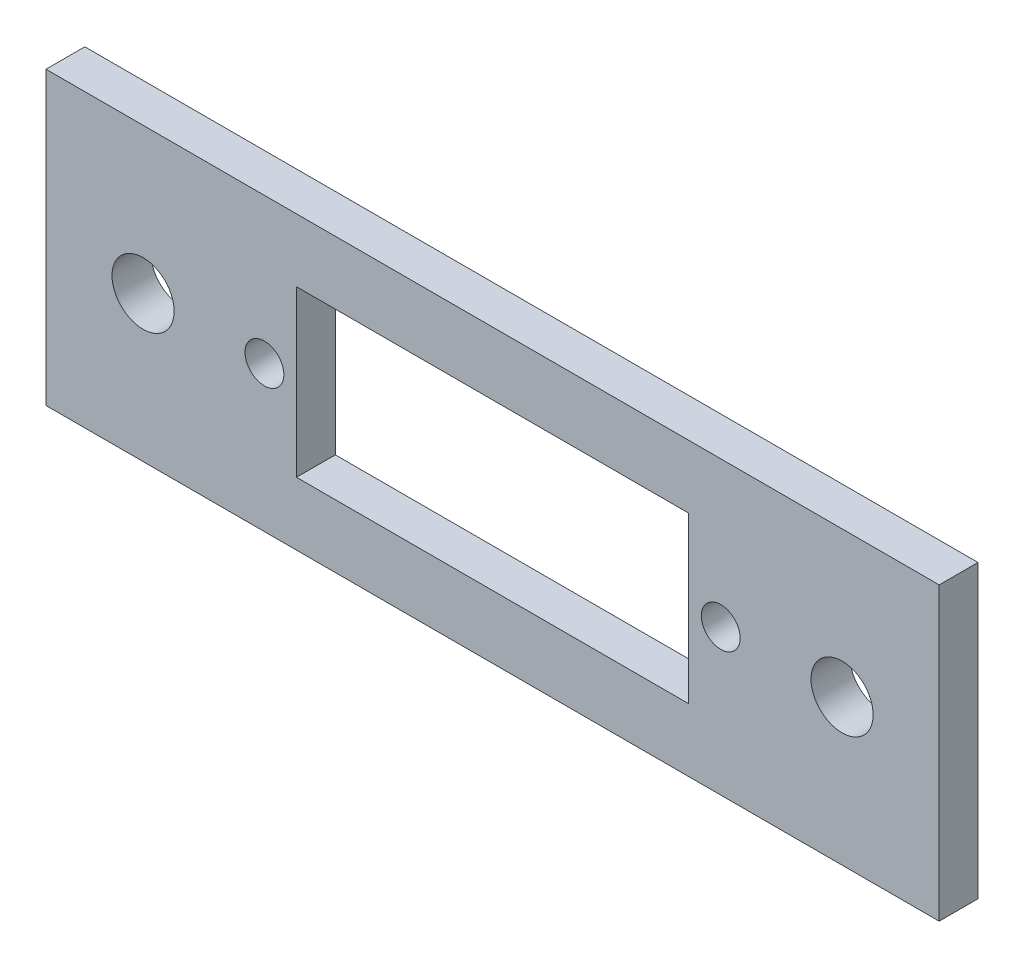
ISO-10303-21;
HEADER;
FILE_DESCRIPTION(('STEP AP214'),'2;1');
FILE_NAME('part.step','',(''),(''),'','','');
FILE_SCHEMA(('AUTOMOTIVE_DESIGN { 1 0 10303 214 1 1 1 1 }'));
ENDSEC;
DATA;
#1=APPLICATION_CONTEXT('core data for automotive mechanical design processes');
#2=APPLICATION_PROTOCOL_DEFINITION('international standard','automotive_design',2000,#1);
#3=PRODUCT_CONTEXT('',#1,'mechanical');
#4=PRODUCT('Part','Part','',(#3));
#5=PRODUCT_RELATED_PRODUCT_CATEGORY('part','',(#4));
#6=PRODUCT_DEFINITION_FORMATION('','',#4);
#7=PRODUCT_DEFINITION_CONTEXT('part definition',#1,'design');
#8=PRODUCT_DEFINITION('design','',#6,#7);
#9=PRODUCT_DEFINITION_SHAPE('','',#8);
#10=(LENGTH_UNIT() NAMED_UNIT(*) SI_UNIT(.MILLI.,.METRE.));
#11=(NAMED_UNIT(*) PLANE_ANGLE_UNIT() SI_UNIT($,.RADIAN.));
#12=(NAMED_UNIT(*) SI_UNIT($,.STERADIAN.) SOLID_ANGLE_UNIT());
#13=UNCERTAINTY_MEASURE_WITH_UNIT(LENGTH_MEASURE(1.E-05),#10,'distance_accuracy_value','');
#14=(GEOMETRIC_REPRESENTATION_CONTEXT(3) GLOBAL_UNCERTAINTY_ASSIGNED_CONTEXT((#13)) GLOBAL_UNIT_ASSIGNED_CONTEXT((#10,
#11,#12)) REPRESENTATION_CONTEXT('',''));
#15=CARTESIAN_POINT('',(0.,0.,0.));
#16=DIRECTION('',(0.,0.,1.));
#17=DIRECTION('',(1.,0.,0.));
#18=AXIS2_PLACEMENT_3D('',#15,#16,#17);
#19=CARTESIAN_POINT('',(0.,0.,0.));
#20=DIRECTION('',(0.,0.,1.));
#21=DIRECTION('',(1.,0.,0.));
#22=AXIS2_PLACEMENT_3D('',#19,#20,#21);
#23=PLANE('',#22);
#24=CARTESIAN_POINT('',(-15.2042400371844,0.,0.));
#25=DIRECTION('',(0.,0.,-1.));
#26=DIRECTION('',(-1.,0.,0.));
#27=AXIS2_PLACEMENT_3D('',#24,#25,#26);
#28=CIRCLE('',#27,1.6);
#29=CARTESIAN_POINT('',(-16.8042400371844,0.,0.));
#30=VERTEX_POINT('',#29);
#31=EDGE_CURVE('E118',#30,#30,#28,.F.);
#32=ORIENTED_EDGE('',*,*,#31,.T.);
#33=EDGE_LOOP('',(#32));
#34=FACE_BOUND('',#33,.T.);
#35=CARTESIAN_POINT('',(14.5457599628156,0.,0.));
#36=DIRECTION('',(0.,0.,-1.));
#37=DIRECTION('',(-1.,0.,0.));
#38=AXIS2_PLACEMENT_3D('',#35,#36,#37);
#39=CIRCLE('',#38,1.);
#40=CARTESIAN_POINT('',(13.5457599628156,0.,0.));
#41=VERTEX_POINT('',#40);
#42=EDGE_CURVE('E121',#41,#41,#39,.F.);
#43=ORIENTED_EDGE('',*,*,#42,.T.);
#44=EDGE_LOOP('',(#43));
#45=FACE_BOUND('',#44,.T.);
#46=DIRECTION('',(1.,0.,0.));
#47=VECTOR('',#46,1.);
#48=CARTESIAN_POINT('',(12.8957599628156,4.25,0.));
#49=LINE('',#48,#47);
#50=CARTESIAN_POINT('',(-7.30424003718442,4.24999999999995,0.));
#51=VERTEX_POINT('',#50);
#52=CARTESIAN_POINT('',(12.8957599628156,4.24999999999998,0.));
#53=VERTEX_POINT('',#52);
#54=EDGE_CURVE('E307',#51,#53,#49,.T.);
#55=ORIENTED_EDGE('',*,*,#54,.F.);
#56=DIRECTION('',(0.,1.,0.));
#57=VECTOR('',#56,1.);
#58=CARTESIAN_POINT('',(-7.30424003718442,4.24999999999995,0.));
#59=LINE('',#58,#57);
#60=CARTESIAN_POINT('',(-7.30424003718442,-4.25,0.));
#61=VERTEX_POINT('',#60);
#62=EDGE_CURVE('E293',#61,#51,#59,.T.);
#63=ORIENTED_EDGE('',*,*,#62,.F.);
#64=DIRECTION('',(1.,0.,0.));
#65=VECTOR('',#64,1.);
#66=CARTESIAN_POINT('',(-7.30424003718442,-4.25,0.));
#67=LINE('',#66,#65);
#68=CARTESIAN_POINT('',(12.8957599628156,-4.25,0.));
#69=VERTEX_POINT('',#68);
#70=EDGE_CURVE('E299',#69,#61,#67,.F.);
#71=ORIENTED_EDGE('',*,*,#70,.F.);
#72=DIRECTION('',(0.,-1.,0.));
#73=VECTOR('',#72,1.);
#74=CARTESIAN_POINT('',(12.8957599628156,-4.25,0.));
#75=LINE('',#74,#73);
#76=EDGE_CURVE('E304',#53,#69,#75,.T.);
#77=ORIENTED_EDGE('',*,*,#76,.F.);
#78=EDGE_LOOP('',(#55,#63,#71,#77));
#79=FACE_BOUND('',#78,.T.);
#80=DIRECTION('',(1.,0.,0.));
#81=VECTOR('',#80,1.);
#82=CARTESIAN_POINT('',(-20.2042400371844,7.49999999999999,0.));
#83=LINE('',#82,#81);
#84=CARTESIAN_POINT('',(-20.2042400371844,7.49999999999999,0.));
#85=VERTEX_POINT('',#84);
#86=CARTESIAN_POINT('',(25.7957599628156,7.49999999999999,0.));
#87=VERTEX_POINT('',#86);
#88=EDGE_CURVE('E310',#85,#87,#83,.T.);
#89=ORIENTED_EDGE('',*,*,#88,.T.);
#90=DIRECTION('',(0.,-1.,0.));
#91=VECTOR('',#90,1.);
#92=CARTESIAN_POINT('',(25.7957599628156,7.49999999999999,0.));
#93=LINE('',#92,#91);
#94=CARTESIAN_POINT('',(25.7957599628156,-7.50000000000001,0.));
#95=VERTEX_POINT('',#94);
#96=EDGE_CURVE('E97',#87,#95,#93,.T.);
#97=ORIENTED_EDGE('',*,*,#96,.T.);
#98=DIRECTION('',(1.,0.,0.));
#99=VECTOR('',#98,1.);
#100=CARTESIAN_POINT('',(-20.2042400371844,-7.50000000000001,0.));
#101=LINE('',#100,#99);
#102=CARTESIAN_POINT('',(-20.2042400371844,-7.50000000000001,0.));
#103=VERTEX_POINT('',#102);
#104=EDGE_CURVE('E80',#95,#103,#101,.F.);
#105=ORIENTED_EDGE('',*,*,#104,.T.);
#106=DIRECTION('',(0.,1.,0.));
#107=VECTOR('',#106,1.);
#108=CARTESIAN_POINT('',(-20.2042400371844,7.49999999999999,0.));
#109=LINE('',#108,#107);
#110=EDGE_CURVE('E85',#103,#85,#109,.T.);
#111=ORIENTED_EDGE('',*,*,#110,.T.);
#112=EDGE_LOOP('',(#89,#97,#105,#111));
#113=FACE_BOUND('',#112,.T.);
#114=CARTESIAN_POINT('',(20.7957599628156,0.,0.));
#115=DIRECTION('',(0.,0.,-1.));
#116=DIRECTION('',(-1.,0.,0.));
#117=AXIS2_PLACEMENT_3D('',#114,#115,#116);
#118=CIRCLE('',#117,1.6);
#119=CARTESIAN_POINT('',(19.1957599628156,0.,0.));
#120=VERTEX_POINT('',#119);
#121=EDGE_CURVE('E94',#120,#120,#118,.F.);
#122=ORIENTED_EDGE('',*,*,#121,.T.);
#123=EDGE_LOOP('',(#122));
#124=FACE_BOUND('',#123,.T.);
#125=CARTESIAN_POINT('',(-8.95424003718442,0.,0.));
#126=DIRECTION('',(0.,0.,-1.));
#127=DIRECTION('',(-1.,0.,0.));
#128=AXIS2_PLACEMENT_3D('',#125,#126,#127);
#129=CIRCLE('',#128,0.999999999999997);
#130=CARTESIAN_POINT('',(-9.95424003718441,0.,0.));
#131=VERTEX_POINT('',#130);
#132=EDGE_CURVE('E20',#131,#131,#129,.F.);
#133=ORIENTED_EDGE('',*,*,#132,.T.);
#134=EDGE_LOOP('',(#133));
#135=FACE_BOUND('',#134,.T.);
#136=ADVANCED_FACE('F17',(#34,#45,#79,#113,#124,#135),#23,.F.);
#137=CARTESIAN_POINT('',(-8.95424003718442,0.,2.));
#138=DIRECTION('',(0.,0.,-1.));
#139=DIRECTION('',(-1.,0.,0.));
#140=AXIS2_PLACEMENT_3D('',#137,#138,#139);
#141=CYLINDRICAL_SURFACE('',#140,0.999999999999997);
#142=CARTESIAN_POINT('',(-8.95424003718442,0.,2.));
#143=DIRECTION('',(0.,0.,-1.));
#144=DIRECTION('',(-1.,0.,0.));
#145=AXIS2_PLACEMENT_3D('',#142,#143,#144);
#146=CIRCLE('',#145,0.999999999999997);
#147=CARTESIAN_POINT('',(-9.95424003718441,0.,2.));
#148=VERTEX_POINT('',#147);
#149=EDGE_CURVE('E115',#148,#148,#146,.T.);
#150=ORIENTED_EDGE('',*,*,#149,.F.);
#151=EDGE_LOOP('',(#150));
#152=FACE_BOUND('',#151,.T.);
#153=ORIENTED_EDGE('',*,*,#132,.F.);
#154=EDGE_LOOP('',(#153));
#155=FACE_BOUND('',#154,.T.);
#156=ADVANCED_FACE('F129',(#152,#155),#141,.F.);
#157=CARTESIAN_POINT('',(20.7957599628156,0.,2.));
#158=DIRECTION('',(0.,0.,-1.));
#159=DIRECTION('',(-1.,0.,0.));
#160=AXIS2_PLACEMENT_3D('',#157,#158,#159);
#161=CYLINDRICAL_SURFACE('',#160,1.6);
#162=CARTESIAN_POINT('',(20.7957599628156,0.,2.));
#163=DIRECTION('',(0.,0.,-1.));
#164=DIRECTION('',(-1.,0.,0.));
#165=AXIS2_PLACEMENT_3D('',#162,#163,#164);
#166=CIRCLE('',#165,1.6);
#167=CARTESIAN_POINT('',(19.1957599628156,0.,2.));
#168=VERTEX_POINT('',#167);
#169=EDGE_CURVE('E111',#168,#168,#166,.T.);
#170=ORIENTED_EDGE('',*,*,#169,.F.);
#171=EDGE_LOOP('',(#170));
#172=FACE_BOUND('',#171,.T.);
#173=ORIENTED_EDGE('',*,*,#121,.F.);
#174=EDGE_LOOP('',(#173));
#175=FACE_BOUND('',#174,.T.);
#176=ADVANCED_FACE('F131',(#172,#175),#161,.F.);
#177=CARTESIAN_POINT('',(-20.2042400371844,7.49999999999999,2.));
#178=DIRECTION('',(1.,0.,0.));
#179=DIRECTION('',(0.,1.,0.));
#180=AXIS2_PLACEMENT_3D('',#177,#178,#179);
#181=PLANE('',#180);
#182=DIRECTION('',(0.,0.,1.));
#183=VECTOR('',#182,1.);
#184=CARTESIAN_POINT('',(-20.2042400371844,-7.50000000000001,2.));
#185=LINE('',#184,#183);
#186=CARTESIAN_POINT('',(-20.2042400371844,-7.50000000000001,2.));
#187=VERTEX_POINT('',#186);
#188=EDGE_CURVE('E87',#103,#187,#185,.T.);
#189=ORIENTED_EDGE('',*,*,#188,.T.);
#190=DIRECTION('',(0.,1.,0.));
#191=VECTOR('',#190,1.);
#192=CARTESIAN_POINT('',(-20.2042400371844,0.,2.));
#193=LINE('',#192,#191);
#194=CARTESIAN_POINT('',(-20.2042400371844,7.49999999999999,2.));
#195=VERTEX_POINT('',#194);
#196=EDGE_CURVE('E114',#195,#187,#193,.F.);
#197=ORIENTED_EDGE('',*,*,#196,.F.);
#198=DIRECTION('',(0.,0.,-1.));
#199=VECTOR('',#198,1.);
#200=CARTESIAN_POINT('',(-20.2042400371844,7.49999999999999,2.));
#201=LINE('',#200,#199);
#202=EDGE_CURVE('E90',#195,#85,#201,.T.);
#203=ORIENTED_EDGE('',*,*,#202,.T.);
#204=ORIENTED_EDGE('',*,*,#110,.F.);
#205=EDGE_LOOP('',(#189,#197,#203,#204));
#206=FACE_BOUND('',#205,.T.);
#207=ADVANCED_FACE('F86',(#206),#181,.F.);
#208=CARTESIAN_POINT('',(-20.2042400371844,-7.50000000000001,2.));
#209=DIRECTION('',(0.,1.,0.));
#210=DIRECTION('',(0.,0.,1.));
#211=AXIS2_PLACEMENT_3D('',#208,#209,#210);
#212=PLANE('',#211);
#213=DIRECTION('',(0.,0.,1.));
#214=VECTOR('',#213,1.);
#215=CARTESIAN_POINT('',(25.7957599628156,-7.50000000000001,2.));
#216=LINE('',#215,#214);
#217=CARTESIAN_POINT('',(25.7957599628156,-7.50000000000001,2.));
#218=VERTEX_POINT('',#217);
#219=EDGE_CURVE('E99',#95,#218,#216,.T.);
#220=ORIENTED_EDGE('',*,*,#219,.T.);
#221=DIRECTION('',(1.,0.,0.));
#222=VECTOR('',#221,1.);
#223=CARTESIAN_POINT('',(0.,-7.50000000000001,2.));
#224=LINE('',#223,#222);
#225=EDGE_CURVE('E103',#187,#218,#224,.T.);
#226=ORIENTED_EDGE('',*,*,#225,.F.);
#227=ORIENTED_EDGE('',*,*,#188,.F.);
#228=ORIENTED_EDGE('',*,*,#104,.F.);
#229=EDGE_LOOP('',(#220,#226,#227,#228));
#230=FACE_BOUND('',#229,.T.);
#231=ADVANCED_FACE('F101',(#230),#212,.F.);
#232=CARTESIAN_POINT('',(25.7957599628156,7.49999999999999,2.));
#233=DIRECTION('',(-1.,0.,0.));
#234=DIRECTION('',(0.,-1.,0.));
#235=AXIS2_PLACEMENT_3D('',#232,#233,#234);
#236=PLANE('',#235);
#237=DIRECTION('',(0.,0.,-1.));
#238=VECTOR('',#237,1.);
#239=CARTESIAN_POINT('',(25.7957599628156,7.49999999999999,2.));
#240=LINE('',#239,#238);
#241=CARTESIAN_POINT('',(25.7957599628156,7.49999999999999,2.));
#242=VERTEX_POINT('',#241);
#243=EDGE_CURVE('E273',#87,#242,#240,.F.);
#244=ORIENTED_EDGE('',*,*,#243,.T.);
#245=DIRECTION('',(0.,1.,0.));
#246=VECTOR('',#245,1.);
#247=CARTESIAN_POINT('',(25.7957599628156,0.,2.));
#248=LINE('',#247,#246);
#249=EDGE_CURVE('E276',#218,#242,#248,.T.);
#250=ORIENTED_EDGE('',*,*,#249,.F.);
#251=ORIENTED_EDGE('',*,*,#219,.F.);
#252=ORIENTED_EDGE('',*,*,#96,.F.);
#253=EDGE_LOOP('',(#244,#250,#251,#252));
#254=FACE_BOUND('',#253,.T.);
#255=ADVANCED_FACE('F176',(#254),#236,.F.);
#256=CARTESIAN_POINT('',(-20.2042400371844,7.49999999999999,2.));
#257=DIRECTION('',(0.,-1.,0.));
#258=DIRECTION('',(0.,0.,-1.));
#259=AXIS2_PLACEMENT_3D('',#256,#257,#258);
#260=PLANE('',#259);
#261=ORIENTED_EDGE('',*,*,#202,.F.);
#262=DIRECTION('',(1.,0.,0.));
#263=VECTOR('',#262,1.);
#264=CARTESIAN_POINT('',(0.,7.49999999999999,2.));
#265=LINE('',#264,#263);
#266=EDGE_CURVE('E279',#242,#195,#265,.F.);
#267=ORIENTED_EDGE('',*,*,#266,.F.);
#268=ORIENTED_EDGE('',*,*,#243,.F.);
#269=ORIENTED_EDGE('',*,*,#88,.F.);
#270=EDGE_LOOP('',(#261,#267,#268,#269));
#271=FACE_BOUND('',#270,.T.);
#272=ADVANCED_FACE('F172',(#271),#260,.F.);
#273=CARTESIAN_POINT('',(12.8957599628156,4.25,2.));
#274=DIRECTION('',(0.,-1.,0.));
#275=DIRECTION('',(1.,0.,0.));
#276=AXIS2_PLACEMENT_3D('',#273,#274,#275);
#277=PLANE('',#276);
#278=DIRECTION('',(1.,0.,0.));
#279=VECTOR('',#278,1.);
#280=CARTESIAN_POINT('',(0.,4.24999999999995,2.));
#281=LINE('',#280,#279);
#282=CARTESIAN_POINT('',(-7.30424003718442,4.24999999999995,2.));
#283=VERTEX_POINT('',#282);
#284=CARTESIAN_POINT('',(12.8957599628156,4.24999999999999,2.));
#285=VERTEX_POINT('',#284);
#286=EDGE_CURVE('E281',#283,#285,#281,.T.);
#287=ORIENTED_EDGE('',*,*,#286,.F.);
#288=DIRECTION('',(0.,0.,-1.));
#289=VECTOR('',#288,1.);
#290=CARTESIAN_POINT('',(-7.30424003718442,4.24999999999995,2.));
#291=LINE('',#290,#289);
#292=EDGE_CURVE('E290',#51,#283,#291,.F.);
#293=ORIENTED_EDGE('',*,*,#292,.F.);
#294=ORIENTED_EDGE('',*,*,#54,.T.);
#295=DIRECTION('',(0.,0.,1.));
#296=VECTOR('',#295,1.);
#297=CARTESIAN_POINT('',(12.8957599628156,4.25,2.));
#298=LINE('',#297,#296);
#299=EDGE_CURVE('E301',#285,#53,#298,.F.);
#300=ORIENTED_EDGE('',*,*,#299,.F.);
#301=EDGE_LOOP('',(#287,#293,#294,#300));
#302=FACE_BOUND('',#301,.T.);
#303=ADVANCED_FACE('F168',(#302),#277,.T.);
#304=CARTESIAN_POINT('',(12.8957599628156,-4.25,2.));
#305=DIRECTION('',(-1.,0.,0.));
#306=DIRECTION('',(0.,-1.,0.));
#307=AXIS2_PLACEMENT_3D('',#304,#305,#306);
#308=PLANE('',#307);
#309=DIRECTION('',(0.,1.,0.));
#310=VECTOR('',#309,1.);
#311=CARTESIAN_POINT('',(12.8957599628156,0.,2.));
#312=LINE('',#311,#310);
#313=CARTESIAN_POINT('',(12.8957599628156,-4.25,2.));
#314=VERTEX_POINT('',#313);
#315=EDGE_CURVE('E317',#285,#314,#312,.F.);
#316=ORIENTED_EDGE('',*,*,#315,.F.);
#317=ORIENTED_EDGE('',*,*,#299,.T.);
#318=ORIENTED_EDGE('',*,*,#76,.T.);
#319=DIRECTION('',(0.,0.,1.));
#320=VECTOR('',#319,1.);
#321=CARTESIAN_POINT('',(12.8957599628156,-4.25,2.));
#322=LINE('',#321,#320);
#323=EDGE_CURVE('E296',#314,#69,#322,.F.);
#324=ORIENTED_EDGE('',*,*,#323,.F.);
#325=EDGE_LOOP('',(#316,#317,#318,#324));
#326=FACE_BOUND('',#325,.T.);
#327=ADVANCED_FACE('F165',(#326),#308,.T.);
#328=CARTESIAN_POINT('',(-7.30424003718442,-4.25,2.));
#329=DIRECTION('',(0.,1.,0.));
#330=DIRECTION('',(0.,0.,1.));
#331=AXIS2_PLACEMENT_3D('',#328,#329,#330);
#332=PLANE('',#331);
#333=DIRECTION('',(1.,0.,0.));
#334=VECTOR('',#333,1.);
#335=CARTESIAN_POINT('',(0.,-4.25,2.));
#336=LINE('',#335,#334);
#337=CARTESIAN_POINT('',(-7.30424003718442,-4.25,2.));
#338=VERTEX_POINT('',#337);
#339=EDGE_CURVE('E321',#314,#338,#336,.F.);
#340=ORIENTED_EDGE('',*,*,#339,.F.);
#341=ORIENTED_EDGE('',*,*,#323,.T.);
#342=ORIENTED_EDGE('',*,*,#70,.T.);
#343=DIRECTION('',(0.,0.,-1.));
#344=VECTOR('',#343,1.);
#345=CARTESIAN_POINT('',(-7.30424003718442,-4.25,2.));
#346=LINE('',#345,#344);
#347=EDGE_CURVE('E35',#338,#61,#346,.T.);
#348=ORIENTED_EDGE('',*,*,#347,.F.);
#349=EDGE_LOOP('',(#340,#341,#342,#348));
#350=FACE_BOUND('',#349,.T.);
#351=ADVANCED_FACE('F161',(#350),#332,.T.);
#352=CARTESIAN_POINT('',(-7.30424003718442,4.24999999999995,2.));
#353=DIRECTION('',(1.,0.,0.));
#354=DIRECTION('',(0.,0.,-1.));
#355=AXIS2_PLACEMENT_3D('',#352,#353,#354);
#356=PLANE('',#355);
#357=DIRECTION('',(0.,1.,0.));
#358=VECTOR('',#357,1.);
#359=CARTESIAN_POINT('',(-7.30424003718442,0.,2.));
#360=LINE('',#359,#358);
#361=EDGE_CURVE('E110',#338,#283,#360,.T.);
#362=ORIENTED_EDGE('',*,*,#361,.F.);
#363=ORIENTED_EDGE('',*,*,#347,.T.);
#364=ORIENTED_EDGE('',*,*,#62,.T.);
#365=ORIENTED_EDGE('',*,*,#292,.T.);
#366=EDGE_LOOP('',(#362,#363,#364,#365));
#367=FACE_BOUND('',#366,.T.);
#368=ADVANCED_FACE('F157',(#367),#356,.T.);
#369=CARTESIAN_POINT('',(14.5457599628156,0.,2.));
#370=DIRECTION('',(0.,0.,-1.));
#371=DIRECTION('',(-1.,0.,0.));
#372=AXIS2_PLACEMENT_3D('',#369,#370,#371);
#373=CYLINDRICAL_SURFACE('',#372,1.);
#374=CARTESIAN_POINT('',(14.5457599628156,0.,2.));
#375=DIRECTION('',(0.,0.,-1.));
#376=DIRECTION('',(-1.,0.,0.));
#377=AXIS2_PLACEMENT_3D('',#374,#375,#376);
#378=CIRCLE('',#377,1.);
#379=CARTESIAN_POINT('',(13.5457599628156,0.,2.));
#380=VERTEX_POINT('',#379);
#381=EDGE_CURVE('E26',#380,#380,#378,.T.);
#382=ORIENTED_EDGE('',*,*,#381,.F.);
#383=EDGE_LOOP('',(#382));
#384=FACE_BOUND('',#383,.T.);
#385=ORIENTED_EDGE('',*,*,#42,.F.);
#386=EDGE_LOOP('',(#385));
#387=FACE_BOUND('',#386,.T.);
#388=ADVANCED_FACE('F150',(#384,#387),#373,.F.);
#389=CARTESIAN_POINT('',(-15.2042400371844,0.,2.));
#390=DIRECTION('',(0.,0.,-1.));
#391=DIRECTION('',(-1.,0.,0.));
#392=AXIS2_PLACEMENT_3D('',#389,#390,#391);
#393=CYLINDRICAL_SURFACE('',#392,1.6);
#394=CARTESIAN_POINT('',(-15.2042400371844,0.,2.));
#395=DIRECTION('',(0.,0.,-1.));
#396=DIRECTION('',(-1.,0.,0.));
#397=AXIS2_PLACEMENT_3D('',#394,#395,#396);
#398=CIRCLE('',#397,1.6);
#399=CARTESIAN_POINT('',(-16.8042400371844,0.,2.));
#400=VERTEX_POINT('',#399);
#401=EDGE_CURVE('E11',#400,#400,#398,.T.);
#402=ORIENTED_EDGE('',*,*,#401,.F.);
#403=EDGE_LOOP('',(#402));
#404=FACE_BOUND('',#403,.T.);
#405=ORIENTED_EDGE('',*,*,#31,.F.);
#406=EDGE_LOOP('',(#405));
#407=FACE_BOUND('',#406,.T.);
#408=ADVANCED_FACE('F144',(#404,#407),#393,.F.);
#409=CARTESIAN_POINT('',(0.,0.,2.));
#410=DIRECTION('',(0.,0.,1.));
#411=DIRECTION('',(1.,0.,0.));
#412=AXIS2_PLACEMENT_3D('',#409,#410,#411);
#413=PLANE('',#412);
#414=ORIENTED_EDGE('',*,*,#401,.T.);
#415=EDGE_LOOP('',(#414));
#416=FACE_BOUND('',#415,.T.);
#417=ORIENTED_EDGE('',*,*,#381,.T.);
#418=EDGE_LOOP('',(#417));
#419=FACE_BOUND('',#418,.T.);
#420=ORIENTED_EDGE('',*,*,#339,.T.);
#421=ORIENTED_EDGE('',*,*,#361,.T.);
#422=ORIENTED_EDGE('',*,*,#286,.T.);
#423=ORIENTED_EDGE('',*,*,#315,.T.);
#424=EDGE_LOOP('',(#420,#421,#422,#423));
#425=FACE_BOUND('',#424,.T.);
#426=ORIENTED_EDGE('',*,*,#249,.T.);
#427=ORIENTED_EDGE('',*,*,#266,.T.);
#428=ORIENTED_EDGE('',*,*,#196,.T.);
#429=ORIENTED_EDGE('',*,*,#225,.T.);
#430=EDGE_LOOP('',(#426,#427,#428,#429));
#431=FACE_BOUND('',#430,.T.);
#432=ORIENTED_EDGE('',*,*,#169,.T.);
#433=EDGE_LOOP('',(#432));
#434=FACE_BOUND('',#433,.T.);
#435=ORIENTED_EDGE('',*,*,#149,.T.);
#436=EDGE_LOOP('',(#435));
#437=FACE_BOUND('',#436,.T.);
#438=ADVANCED_FACE('F142',(#416,#419,#425,#431,#434,#437),#413,.T.);
#439=CLOSED_SHELL('',(#136,#156,#176,#207,#231,#255,#272,#303,#327,#351,#368,#388,#408,#438));
#440=MANIFOLD_SOLID_BREP('B1',#439);
#441=ADVANCED_BREP_SHAPE_REPRESENTATION('',(#18,#440),#14);
#442=SHAPE_DEFINITION_REPRESENTATION(#9,#441);
ENDSEC;
END-ISO-10303-21;
